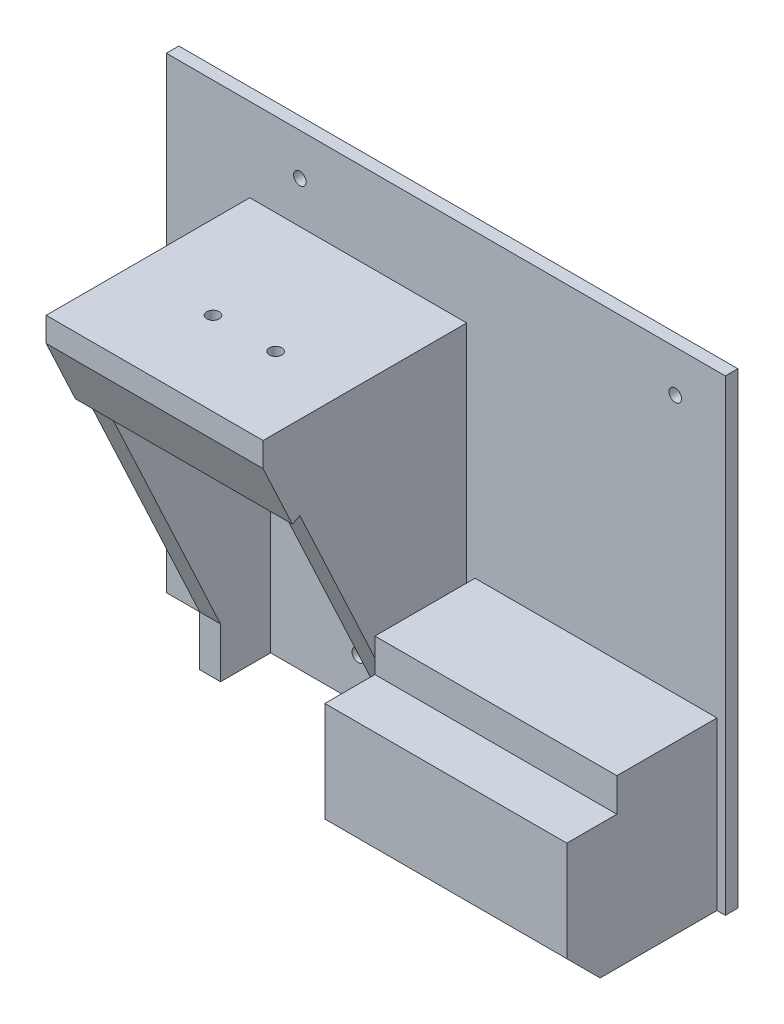
ISO-10303-21;
HEADER;
FILE_DESCRIPTION(('STEP AP214'),'2;1');
FILE_NAME('part.step','',(''),(''),'','','');
FILE_SCHEMA(('AUTOMOTIVE_DESIGN { 1 0 10303 214 1 1 1 1 }'));
ENDSEC;
DATA;
#1=APPLICATION_CONTEXT('core data for automotive mechanical design processes');
#2=APPLICATION_PROTOCOL_DEFINITION('international standard','automotive_design',2000,#1);
#3=PRODUCT_CONTEXT('',#1,'mechanical');
#4=PRODUCT('Part','Part','',(#3));
#5=PRODUCT_RELATED_PRODUCT_CATEGORY('part','',(#4));
#6=PRODUCT_DEFINITION_FORMATION('','',#4);
#7=PRODUCT_DEFINITION_CONTEXT('part definition',#1,'design');
#8=PRODUCT_DEFINITION('design','',#6,#7);
#9=PRODUCT_DEFINITION_SHAPE('','',#8);
#10=(LENGTH_UNIT() NAMED_UNIT(*) SI_UNIT(.MILLI.,.METRE.));
#11=(NAMED_UNIT(*) PLANE_ANGLE_UNIT() SI_UNIT($,.RADIAN.));
#12=(NAMED_UNIT(*) SI_UNIT($,.STERADIAN.) SOLID_ANGLE_UNIT());
#13=UNCERTAINTY_MEASURE_WITH_UNIT(LENGTH_MEASURE(1.E-05),#10,'distance_accuracy_value','');
#14=(GEOMETRIC_REPRESENTATION_CONTEXT(3) GLOBAL_UNCERTAINTY_ASSIGNED_CONTEXT((#13)) GLOBAL_UNIT_ASSIGNED_CONTEXT((#10,
#11,#12)) REPRESENTATION_CONTEXT('',''));
#15=CARTESIAN_POINT('',(0.,0.,0.));
#16=DIRECTION('',(0.,0.,1.));
#17=DIRECTION('',(1.,0.,0.));
#18=AXIS2_PLACEMENT_3D('',#15,#16,#17);
#19=CARTESIAN_POINT('',(96.,-6.,39.));
#20=DIRECTION('',(0.,-1.,0.));
#21=DIRECTION('',(1.,0.,0.));
#22=AXIS2_PLACEMENT_3D('',#19,#20,#21);
#23=PLANE('',#22);
#24=DIRECTION('',(-1.,0.,0.));
#25=VECTOR('',#24,1.);
#26=CARTESIAN_POINT('',(38.,-6.00000000000001,27.));
#27=LINE('',#26,#25);
#28=CARTESIAN_POINT('',(96.,-6.00000000000001,27.));
#29=VERTEX_POINT('',#28);
#30=CARTESIAN_POINT('',(38.,-6.00000000000001,27.));
#31=VERTEX_POINT('',#30);
#32=EDGE_CURVE('E215',#29,#31,#27,.T.);
#33=ORIENTED_EDGE('',*,*,#32,.F.);
#34=DIRECTION('',(0.,0.,-1.));
#35=VECTOR('',#34,1.);
#36=CARTESIAN_POINT('',(96.,-6.,39.));
#37=LINE('',#36,#35);
#38=CARTESIAN_POINT('',(96.,-6.,3.));
#39=VERTEX_POINT('',#38);
#40=EDGE_CURVE('E247',#29,#39,#37,.T.);
#41=ORIENTED_EDGE('',*,*,#40,.T.);
#42=DIRECTION('',(-1.,0.,0.));
#43=VECTOR('',#42,1.);
#44=CARTESIAN_POINT('',(96.,-6.,3.));
#45=LINE('',#44,#43);
#46=CARTESIAN_POINT('',(38.,-6.00000000000001,3.));
#47=VERTEX_POINT('',#46);
#48=EDGE_CURVE('E237',#39,#47,#45,.T.);
#49=ORIENTED_EDGE('',*,*,#48,.T.);
#50=DIRECTION('',(0.,0.,-1.));
#51=VECTOR('',#50,1.);
#52=CARTESIAN_POINT('',(38.,-6.00000000000001,39.));
#53=LINE('',#52,#51);
#54=EDGE_CURVE('E245',#31,#47,#53,.T.);
#55=ORIENTED_EDGE('',*,*,#54,.F.);
#56=EDGE_LOOP('',(#33,#41,#49,#55));
#57=FACE_BOUND('',#56,.T.);
#58=ADVANCED_FACE('F36',(#57),#23,.F.);
#59=CARTESIAN_POINT('',(0.,0.,3.));
#60=DIRECTION('',(0.,0.,-1.));
#61=DIRECTION('',(-1.,0.,0.));
#62=AXIS2_PLACEMENT_3D('',#59,#60,#61);
#63=PLANE('',#62);
#64=CARTESIAN_POINT('',(86.,56.,3.));
#65=DIRECTION('',(0.,0.,1.));
#66=DIRECTION('',(1.,0.,0.));
#67=AXIS2_PLACEMENT_3D('',#64,#65,#66);
#68=CIRCLE('',#67,1.5);
#69=CARTESIAN_POINT('',(87.5,56.,3.));
#70=VERTEX_POINT('',#69);
#71=EDGE_CURVE('E864',#70,#70,#68,.T.);
#72=ORIENTED_EDGE('',*,*,#71,.F.);
#73=EDGE_LOOP('',(#72));
#74=FACE_BOUND('',#73,.T.);
#75=CARTESIAN_POINT('',(-4.,56.,3.));
#76=DIRECTION('',(0.,0.,1.));
#77=DIRECTION('',(1.,0.,0.));
#78=AXIS2_PLACEMENT_3D('',#75,#76,#77);
#79=CIRCLE('',#78,1.5);
#80=CARTESIAN_POINT('',(-2.5,56.,3.));
#81=VERTEX_POINT('',#80);
#82=EDGE_CURVE('E874',#81,#81,#79,.T.);
#83=ORIENTED_EDGE('',*,*,#82,.F.);
#84=EDGE_LOOP('',(#83));
#85=FACE_BOUND('',#84,.T.);
#86=DIRECTION('',(0.,1.,0.));
#87=VECTOR('',#86,1.);
#88=CARTESIAN_POINT('',(96.,-46.,3.));
#89=LINE('',#88,#87);
#90=CARTESIAN_POINT('',(96.,-46.,3.));
#91=VERTEX_POINT('',#90);
#92=EDGE_CURVE('E224',#91,#39,#89,.T.);
#93=ORIENTED_EDGE('',*,*,#92,.F.);
#94=DIRECTION('',(-1.,0.,0.));
#95=VECTOR('',#94,1.);
#96=CARTESIAN_POINT('',(98.,-46.,3.));
#97=LINE('',#96,#95);
#98=CARTESIAN_POINT('',(98.,-46.,3.));
#99=VERTEX_POINT('',#98);
#100=EDGE_CURVE('E266',#99,#91,#97,.T.);
#101=ORIENTED_EDGE('',*,*,#100,.F.);
#102=DIRECTION('',(0.,-1.,0.));
#103=VECTOR('',#102,1.);
#104=CARTESIAN_POINT('',(98.,-46.,3.));
#105=LINE('',#104,#103);
#106=CARTESIAN_POINT('',(98.,66.,3.));
#107=VERTEX_POINT('',#106);
#108=EDGE_CURVE('E255',#107,#99,#105,.T.);
#109=ORIENTED_EDGE('',*,*,#108,.F.);
#110=DIRECTION('',(1.,0.,0.));
#111=VECTOR('',#110,1.);
#112=CARTESIAN_POINT('',(36.,66.,3.));
#113=LINE('',#112,#111);
#114=CARTESIAN_POINT('',(-36.,66.,3.));
#115=VERTEX_POINT('',#114);
#116=EDGE_CURVE('E275',#115,#107,#113,.T.);
#117=ORIENTED_EDGE('',*,*,#116,.F.);
#118=DIRECTION('',(0.,-1.,0.));
#119=VECTOR('',#118,1.);
#120=CARTESIAN_POINT('',(-36.,-46.,3.));
#121=LINE('',#120,#119);
#122=CARTESIAN_POINT('',(-36.,-46.,3.));
#123=VERTEX_POINT('',#122);
#124=EDGE_CURVE('E385',#115,#123,#121,.T.);
#125=ORIENTED_EDGE('',*,*,#124,.T.);
#126=DIRECTION('',(1.,0.,0.));
#127=VECTOR('',#126,1.);
#128=CARTESIAN_POINT('',(-36.,-46.,3.));
#129=LINE('',#128,#127);
#130=CARTESIAN_POINT('',(-16.,-46.,3.));
#131=VERTEX_POINT('',#130);
#132=EDGE_CURVE('E389',#123,#131,#129,.T.);
#133=ORIENTED_EDGE('',*,*,#132,.T.);
#134=DIRECTION('',(0.,-1.,0.));
#135=VECTOR('',#134,1.);
#136=CARTESIAN_POINT('',(-16.,-46.,3.));
#137=LINE('',#136,#135);
#138=CARTESIAN_POINT('',(-16.,46.,3.));
#139=VERTEX_POINT('',#138);
#140=EDGE_CURVE('E369',#139,#131,#137,.T.);
#141=ORIENTED_EDGE('',*,*,#140,.F.);
#142=DIRECTION('',(1.,0.,0.));
#143=VECTOR('',#142,1.);
#144=CARTESIAN_POINT('',(36.,46.,3.));
#145=LINE('',#144,#143);
#146=CARTESIAN_POINT('',(36.,46.,3.));
#147=VERTEX_POINT('',#146);
#148=EDGE_CURVE('E265',#139,#147,#145,.T.);
#149=ORIENTED_EDGE('',*,*,#148,.T.);
#150=DIRECTION('',(0.,-1.,0.));
#151=VECTOR('',#150,1.);
#152=CARTESIAN_POINT('',(36.,-46.,3.));
#153=LINE('',#152,#151);
#154=CARTESIAN_POINT('',(36.,-46.,3.));
#155=VERTEX_POINT('',#154);
#156=EDGE_CURVE('E261',#147,#155,#153,.T.);
#157=ORIENTED_EDGE('',*,*,#156,.T.);
#158=CARTESIAN_POINT('',(38.,-46.,3.));
#159=VERTEX_POINT('',#158);
#160=EDGE_CURVE('E260',#159,#155,#97,.T.);
#161=ORIENTED_EDGE('',*,*,#160,.F.);
#162=DIRECTION('',(0.,-1.,0.));
#163=VECTOR('',#162,1.);
#164=CARTESIAN_POINT('',(38.,-46.,3.));
#165=LINE('',#164,#163);
#166=EDGE_CURVE('E232',#47,#159,#165,.T.);
#167=ORIENTED_EDGE('',*,*,#166,.F.);
#168=ORIENTED_EDGE('',*,*,#48,.F.);
#169=EDGE_LOOP('',(#93,#101,#109,#117,#125,#133,#141,#149,#157,#161,#167,#168));
#170=FACE_BOUND('',#169,.T.);
#171=ADVANCED_FACE('F427',(#74,#85,#170),#63,.F.);
#172=CARTESIAN_POINT('',(36.,-46.,3.));
#173=DIRECTION('',(-1.,0.,0.));
#174=DIRECTION('',(0.,-1.,0.));
#175=AXIS2_PLACEMENT_3D('',#172,#173,#174);
#176=PLANE('',#175);
#177=ORIENTED_EDGE('',*,*,#156,.F.);
#178=DIRECTION('',(0.,0.,-1.));
#179=VECTOR('',#178,1.);
#180=CARTESIAN_POINT('',(36.,46.,3.));
#181=LINE('',#180,#179);
#182=CARTESIAN_POINT('',(36.,46.,51.8123662799905));
#183=VERTEX_POINT('',#182);
#184=EDGE_CURVE('E400',#183,#147,#181,.T.);
#185=ORIENTED_EDGE('',*,*,#184,.F.);
#186=DIRECTION('',(0.,1.,0.));
#187=VECTOR('',#186,1.);
#188=CARTESIAN_POINT('',(36.,0.,51.8123662799905));
#189=LINE('',#188,#187);
#190=CARTESIAN_POINT('',(36.,40.1542290693378,51.8123662799905));
#191=VERTEX_POINT('',#190);
#192=EDGE_CURVE('E310',#191,#183,#189,.T.);
#193=ORIENTED_EDGE('',*,*,#192,.F.);
#194=DIRECTION('',(0.,0.906183139995265,0.422885465331124));
#195=VECTOR('',#194,1.);
#196=CARTESIAN_POINT('',(36.,40.1542290693378,51.8123662799905));
#197=LINE('',#196,#195);
#198=CARTESIAN_POINT('',(36.,25.1542290693377,44.8123662799905));
#199=VERTEX_POINT('',#198);
#200=EDGE_CURVE('E322',#199,#191,#197,.T.);
#201=ORIENTED_EDGE('',*,*,#200,.F.);
#202=DIRECTION('',(0.,0.422885465331124,-0.906183139995265));
#203=VECTOR('',#202,1.);
#204=CARTESIAN_POINT('',(36.,25.1542290693377,44.8123662799905));
#205=LINE('',#204,#203);
#206=CARTESIAN_POINT('',(36.,26.,43.));
#207=VERTEX_POINT('',#206);
#208=EDGE_CURVE('E328',#199,#207,#205,.T.);
#209=ORIENTED_EDGE('',*,*,#208,.T.);
#210=DIRECTION('',(0.,0.906183139995265,0.422885465331124));
#211=VECTOR('',#210,1.);
#212=CARTESIAN_POINT('',(36.,-11.8284671532847,25.3467153284672));
#213=LINE('',#212,#211);
#214=CARTESIAN_POINT('',(36.,-34.,15.));
#215=VERTEX_POINT('',#214);
#216=EDGE_CURVE('E342',#215,#207,#213,.T.);
#217=ORIENTED_EDGE('',*,*,#216,.F.);
#218=DIRECTION('',(0.,1.,0.));
#219=VECTOR('',#218,1.);
#220=CARTESIAN_POINT('',(36.,0.,15.));
#221=LINE('',#220,#219);
#222=CARTESIAN_POINT('',(36.,-46.,15.));
#223=VERTEX_POINT('',#222);
#224=EDGE_CURVE('E364',#223,#215,#221,.T.);
#225=ORIENTED_EDGE('',*,*,#224,.F.);
#226=DIRECTION('',(0.,0.,-1.));
#227=VECTOR('',#226,1.);
#228=CARTESIAN_POINT('',(36.,-46.,3.));
#229=LINE('',#228,#227);
#230=EDGE_CURVE('E392',#223,#155,#229,.T.);
#231=ORIENTED_EDGE('',*,*,#230,.T.);
#232=EDGE_LOOP('',(#177,#185,#193,#201,#209,#217,#225,#231));
#233=FACE_BOUND('',#232,.T.);
#234=ADVANCED_FACE('F425',(#233),#176,.F.);
#235=CARTESIAN_POINT('',(-36.,46.,3.));
#236=DIRECTION('',(0.,-1.,0.));
#237=DIRECTION('',(0.,0.,-1.));
#238=AXIS2_PLACEMENT_3D('',#235,#236,#237);
#239=PLANE('',#238);
#240=CARTESIAN_POINT('',(19.,46.,31.8123662799905));
#241=DIRECTION('',(0.,1.,0.));
#242=DIRECTION('',(0.,0.,1.));
#243=AXIS2_PLACEMENT_3D('',#240,#241,#242);
#244=CIRCLE('',#243,1.5);
#245=CARTESIAN_POINT('',(19.,46.,33.3123662799905));
#246=VERTEX_POINT('',#245);
#247=EDGE_CURVE('E288',#246,#246,#244,.T.);
#248=ORIENTED_EDGE('',*,*,#247,.F.);
#249=EDGE_LOOP('',(#248));
#250=FACE_BOUND('',#249,.T.);
#251=CARTESIAN_POINT('',(3.99999999999998,46.,31.8123662799905));
#252=DIRECTION('',(0.,1.,0.));
#253=DIRECTION('',(0.,0.,1.));
#254=AXIS2_PLACEMENT_3D('',#251,#252,#253);
#255=CIRCLE('',#254,1.5);
#256=CARTESIAN_POINT('',(3.99999999999998,46.,33.3123662799905));
#257=VERTEX_POINT('',#256);
#258=EDGE_CURVE('E281',#257,#257,#255,.T.);
#259=ORIENTED_EDGE('',*,*,#258,.F.);
#260=EDGE_LOOP('',(#259));
#261=FACE_BOUND('',#260,.T.);
#262=ORIENTED_EDGE('',*,*,#148,.F.);
#263=DIRECTION('',(0.,0.,-1.));
#264=VECTOR('',#263,1.);
#265=CARTESIAN_POINT('',(-16.,46.,50.));
#266=LINE('',#265,#264);
#267=CARTESIAN_POINT('',(-16.,46.,51.8123662799905));
#268=VERTEX_POINT('',#267);
#269=EDGE_CURVE('E376',#268,#139,#266,.T.);
#270=ORIENTED_EDGE('',*,*,#269,.F.);
#271=DIRECTION('',(-1.,0.,0.));
#272=VECTOR('',#271,1.);
#273=CARTESIAN_POINT('',(0.,46.,51.8123662799905));
#274=LINE('',#273,#272);
#275=EDGE_CURVE('E313',#183,#268,#274,.T.);
#276=ORIENTED_EDGE('',*,*,#275,.F.);
#277=ORIENTED_EDGE('',*,*,#184,.T.);
#278=EDGE_LOOP('',(#262,#270,#276,#277));
#279=FACE_BOUND('',#278,.T.);
#280=ADVANCED_FACE('F430',(#250,#261,#279),#239,.F.);
#281=CARTESIAN_POINT('',(36.001,-11.8284671532847,25.3467153284672));
#282=DIRECTION('',(0.,0.422885465331124,-0.906183139995265));
#283=DIRECTION('',(0.,0.906183139995265,0.422885465331124));
#284=AXIS2_PLACEMENT_3D('',#281,#282,#283);
#285=PLANE('',#284);
#286=DIRECTION('',(1.,0.,0.));
#287=VECTOR('',#286,1.);
#288=CARTESIAN_POINT('',(-16.,26.,43.));
#289=LINE('',#288,#287);
#290=CARTESIAN_POINT('',(-16.,26.,43.));
#291=VERTEX_POINT('',#290);
#292=CARTESIAN_POINT('',(-11.,26.,43.));
#293=VERTEX_POINT('',#292);
#294=EDGE_CURVE('E316',#291,#293,#289,.T.);
#295=ORIENTED_EDGE('',*,*,#294,.F.);
#296=DIRECTION('',(0.,-0.906183139995265,-0.422885465331124));
#297=VECTOR('',#296,1.);
#298=CARTESIAN_POINT('',(-16.,-11.8284671532847,25.3467153284672));
#299=LINE('',#298,#297);
#300=CARTESIAN_POINT('',(-16.,-34.,15.));
#301=VERTEX_POINT('',#300);
#302=EDGE_CURVE('E347',#291,#301,#299,.T.);
#303=ORIENTED_EDGE('',*,*,#302,.T.);
#304=DIRECTION('',(-1.,0.,0.));
#305=VECTOR('',#304,1.);
#306=CARTESIAN_POINT('',(36.001,-34.,15.));
#307=LINE('',#306,#305);
#308=CARTESIAN_POINT('',(-11.,-34.,15.));
#309=VERTEX_POINT('',#308);
#310=EDGE_CURVE('E351',#309,#301,#307,.T.);
#311=ORIENTED_EDGE('',*,*,#310,.F.);
#312=DIRECTION('',(0.,0.906183139995265,0.422885465331124));
#313=VECTOR('',#312,1.);
#314=CARTESIAN_POINT('',(-11.,-11.8284671532847,25.3467153284672));
#315=LINE('',#314,#313);
#316=EDGE_CURVE('E336',#309,#293,#315,.T.);
#317=ORIENTED_EDGE('',*,*,#316,.T.);
#318=EDGE_LOOP('',(#295,#303,#311,#317));
#319=FACE_BOUND('',#318,.T.);
#320=ADVANCED_FACE('F473',(#319),#285,.F.);
#321=DIRECTION('',(1.,0.,0.));
#322=VECTOR('',#321,1.);
#323=CARTESIAN_POINT('',(36.001,26.,43.));
#324=LINE('',#323,#322);
#325=CARTESIAN_POINT('',(31.,26.,43.));
#326=VERTEX_POINT('',#325);
#327=EDGE_CURVE('E280',#326,#207,#324,.T.);
#328=ORIENTED_EDGE('',*,*,#327,.F.);
#329=DIRECTION('',(0.,-0.906183139995265,-0.422885465331124));
#330=VECTOR('',#329,1.);
#331=CARTESIAN_POINT('',(31.,-11.8284671532847,25.3467153284672));
#332=LINE('',#331,#330);
#333=CARTESIAN_POINT('',(31.,-34.,15.));
#334=VERTEX_POINT('',#333);
#335=EDGE_CURVE('E339',#326,#334,#332,.T.);
#336=ORIENTED_EDGE('',*,*,#335,.T.);
#337=EDGE_CURVE('E356',#215,#334,#307,.T.);
#338=ORIENTED_EDGE('',*,*,#337,.F.);
#339=ORIENTED_EDGE('',*,*,#216,.T.);
#340=EDGE_LOOP('',(#328,#336,#338,#339));
#341=FACE_BOUND('',#340,.T.);
#342=ADVANCED_FACE('F447',(#341),#285,.F.);
#343=CARTESIAN_POINT('',(9.99999999999998,-36.,3.));
#344=DIRECTION('',(0.,0.,1.));
#345=DIRECTION('',(1.,0.,0.));
#346=AXIS2_PLACEMENT_3D('',#343,#344,#345);
#347=CIRCLE('',#346,1.5);
#348=CARTESIAN_POINT('',(11.5,-36.,3.));
#349=VERTEX_POINT('',#348);
#350=EDGE_CURVE('E866',#349,#349,#347,.T.);
#351=ORIENTED_EDGE('',*,*,#350,.F.);
#352=EDGE_LOOP('',(#351));
#353=FACE_BOUND('',#352,.T.);
#354=DIRECTION('',(0.,-1.,0.));
#355=VECTOR('',#354,1.);
#356=CARTESIAN_POINT('',(31.,-46.,3.));
#357=LINE('',#356,#355);
#358=CARTESIAN_POINT('',(31.,43.,3.));
#359=VERTEX_POINT('',#358);
#360=CARTESIAN_POINT('',(31.,-46.,3.));
#361=VERTEX_POINT('',#360);
#362=EDGE_CURVE('E379',#359,#361,#357,.T.);
#363=ORIENTED_EDGE('',*,*,#362,.F.);
#364=DIRECTION('',(1.,0.,0.));
#365=VECTOR('',#364,1.);
#366=CARTESIAN_POINT('',(-11.,43.,3.));
#367=LINE('',#366,#365);
#368=CARTESIAN_POINT('',(-11.,43.,3.));
#369=VERTEX_POINT('',#368);
#370=EDGE_CURVE('E301',#369,#359,#367,.T.);
#371=ORIENTED_EDGE('',*,*,#370,.F.);
#372=DIRECTION('',(0.,1.,0.));
#373=VECTOR('',#372,1.);
#374=CARTESIAN_POINT('',(-11.,-46.,3.));
#375=LINE('',#374,#373);
#376=CARTESIAN_POINT('',(-11.,-46.,3.));
#377=VERTEX_POINT('',#376);
#378=EDGE_CURVE('E367',#377,#369,#375,.T.);
#379=ORIENTED_EDGE('',*,*,#378,.F.);
#380=EDGE_CURVE('E387',#377,#361,#129,.T.);
#381=ORIENTED_EDGE('',*,*,#380,.T.);
#382=EDGE_LOOP('',(#363,#371,#379,#381));
#383=FACE_BOUND('',#382,.T.);
#384=ADVANCED_FACE('F462',(#353,#383),#63,.F.);
#385=CARTESIAN_POINT('',(-36.,-46.,3.));
#386=DIRECTION('',(1.,0.,0.));
#387=DIRECTION('',(0.,1.,0.));
#388=AXIS2_PLACEMENT_3D('',#385,#386,#387);
#389=PLANE('',#388);
#390=DIRECTION('',(0.,-1.,0.));
#391=VECTOR('',#390,1.);
#392=CARTESIAN_POINT('',(-36.,-46.,0.));
#393=LINE('',#392,#391);
#394=CARTESIAN_POINT('',(-36.,66.,0.));
#395=VERTEX_POINT('',#394);
#396=CARTESIAN_POINT('',(-36.,-46.,0.));
#397=VERTEX_POINT('',#396);
#398=EDGE_CURVE('E384',#395,#397,#393,.T.);
#399=ORIENTED_EDGE('',*,*,#398,.T.);
#400=DIRECTION('',(0.,0.,-1.));
#401=VECTOR('',#400,1.);
#402=CARTESIAN_POINT('',(-36.,-46.,3.));
#403=LINE('',#402,#401);
#404=EDGE_CURVE('E397',#123,#397,#403,.T.);
#405=ORIENTED_EDGE('',*,*,#404,.F.);
#406=ORIENTED_EDGE('',*,*,#124,.F.);
#407=DIRECTION('',(0.,0.,1.));
#408=VECTOR('',#407,1.);
#409=CARTESIAN_POINT('',(-36.,66.,0.));
#410=LINE('',#409,#408);
#411=EDGE_CURVE('E272',#395,#115,#410,.T.);
#412=ORIENTED_EDGE('',*,*,#411,.F.);
#413=EDGE_LOOP('',(#399,#405,#406,#412));
#414=FACE_BOUND('',#413,.T.);
#415=ADVANCED_FACE('F488',(#414),#389,.F.);
#416=CARTESIAN_POINT('',(-36.,-46.,3.));
#417=DIRECTION('',(0.,1.,0.));
#418=DIRECTION('',(0.,0.,1.));
#419=AXIS2_PLACEMENT_3D('',#416,#417,#418);
#420=PLANE('',#419);
#421=DIRECTION('',(0.,0.,-1.));
#422=VECTOR('',#421,1.);
#423=CARTESIAN_POINT('',(96.,-46.,39.));
#424=LINE('',#423,#422);
#425=CARTESIAN_POINT('',(96.,-46.,31.));
#426=VERTEX_POINT('',#425);
#427=EDGE_CURVE('E234',#426,#91,#424,.T.);
#428=ORIENTED_EDGE('',*,*,#427,.F.);
#429=DIRECTION('',(-1.,0.,0.));
#430=VECTOR('',#429,1.);
#431=CARTESIAN_POINT('',(38.,-46.,31.));
#432=LINE('',#431,#430);
#433=CARTESIAN_POINT('',(38.,-46.,31.));
#434=VERTEX_POINT('',#433);
#435=EDGE_CURVE('E45',#426,#434,#432,.T.);
#436=ORIENTED_EDGE('',*,*,#435,.T.);
#437=DIRECTION('',(0.,0.,-1.));
#438=VECTOR('',#437,1.);
#439=CARTESIAN_POINT('',(38.,-46.,39.));
#440=LINE('',#439,#438);
#441=EDGE_CURVE('E243',#434,#159,#440,.T.);
#442=ORIENTED_EDGE('',*,*,#441,.T.);
#443=ORIENTED_EDGE('',*,*,#160,.T.);
#444=ORIENTED_EDGE('',*,*,#230,.F.);
#445=DIRECTION('',(-1.,0.,0.));
#446=VECTOR('',#445,1.);
#447=CARTESIAN_POINT('',(36.001,-46.,15.));
#448=LINE('',#447,#446);
#449=CARTESIAN_POINT('',(31.,-46.,15.));
#450=VERTEX_POINT('',#449);
#451=EDGE_CURVE('E355',#223,#450,#448,.T.);
#452=ORIENTED_EDGE('',*,*,#451,.T.);
#453=DIRECTION('',(0.,0.,-1.));
#454=VECTOR('',#453,1.);
#455=CARTESIAN_POINT('',(31.,-46.,50.));
#456=LINE('',#455,#454);
#457=EDGE_CURVE('E382',#450,#361,#456,.T.);
#458=ORIENTED_EDGE('',*,*,#457,.T.);
#459=ORIENTED_EDGE('',*,*,#380,.F.);
#460=DIRECTION('',(0.,0.,-1.));
#461=VECTOR('',#460,1.);
#462=CARTESIAN_POINT('',(-11.,-46.,50.));
#463=LINE('',#462,#461);
#464=CARTESIAN_POINT('',(-11.,-46.,15.));
#465=VERTEX_POINT('',#464);
#466=EDGE_CURVE('E372',#465,#377,#463,.T.);
#467=ORIENTED_EDGE('',*,*,#466,.F.);
#468=CARTESIAN_POINT('',(-16.,-46.,15.));
#469=VERTEX_POINT('',#468);
#470=EDGE_CURVE('E352',#465,#469,#448,.T.);
#471=ORIENTED_EDGE('',*,*,#470,.T.);
#472=DIRECTION('',(0.,0.,-1.));
#473=VECTOR('',#472,1.);
#474=CARTESIAN_POINT('',(-16.,-46.,50.));
#475=LINE('',#474,#473);
#476=EDGE_CURVE('E374',#469,#131,#475,.T.);
#477=ORIENTED_EDGE('',*,*,#476,.T.);
#478=ORIENTED_EDGE('',*,*,#132,.F.);
#479=ORIENTED_EDGE('',*,*,#404,.T.);
#480=DIRECTION('',(1.,0.,0.));
#481=VECTOR('',#480,1.);
#482=CARTESIAN_POINT('',(-36.,-46.,0.));
#483=LINE('',#482,#481);
#484=CARTESIAN_POINT('',(98.,-46.,0.));
#485=VERTEX_POINT('',#484);
#486=EDGE_CURVE('E388',#397,#485,#483,.T.);
#487=ORIENTED_EDGE('',*,*,#486,.T.);
#488=DIRECTION('',(0.,0.,-1.));
#489=VECTOR('',#488,1.);
#490=CARTESIAN_POINT('',(98.,-46.,0.));
#491=LINE('',#490,#489);
#492=EDGE_CURVE('E257',#99,#485,#491,.T.);
#493=ORIENTED_EDGE('',*,*,#492,.F.);
#494=ORIENTED_EDGE('',*,*,#100,.T.);
#495=EDGE_LOOP('',(#428,#436,#442,#443,#444,#452,#458,#459,#467,#471,#477,#478,#479,#487,#493,#494));
#496=FACE_BOUND('',#495,.T.);
#497=ADVANCED_FACE('F414',(#496),#420,.F.);
#498=CARTESIAN_POINT('',(0.,0.,0.));
#499=DIRECTION('',(0.,0.,-1.));
#500=DIRECTION('',(-1.,0.,0.));
#501=AXIS2_PLACEMENT_3D('',#498,#499,#500);
#502=PLANE('',#501);
#503=CARTESIAN_POINT('',(86.,56.,0.));
#504=DIRECTION('',(0.,0.,-1.));
#505=DIRECTION('',(-1.,0.,0.));
#506=AXIS2_PLACEMENT_3D('',#503,#504,#505);
#507=CIRCLE('',#506,1.5);
#508=CARTESIAN_POINT('',(84.5,56.,0.));
#509=VERTEX_POINT('',#508);
#510=EDGE_CURVE('E861',#509,#509,#507,.F.);
#511=ORIENTED_EDGE('',*,*,#510,.T.);
#512=EDGE_LOOP('',(#511));
#513=FACE_BOUND('',#512,.T.);
#514=CARTESIAN_POINT('',(9.99999999999998,-36.,0.));
#515=DIRECTION('',(0.,0.,-1.));
#516=DIRECTION('',(-1.,0.,0.));
#517=AXIS2_PLACEMENT_3D('',#514,#515,#516);
#518=CIRCLE('',#517,1.5);
#519=CARTESIAN_POINT('',(8.49999999999998,-36.,0.));
#520=VERTEX_POINT('',#519);
#521=EDGE_CURVE('E871',#520,#520,#518,.F.);
#522=ORIENTED_EDGE('',*,*,#521,.T.);
#523=EDGE_LOOP('',(#522));
#524=FACE_BOUND('',#523,.T.);
#525=CARTESIAN_POINT('',(-4.,56.,0.));
#526=DIRECTION('',(0.,0.,-1.));
#527=DIRECTION('',(-1.,0.,0.));
#528=AXIS2_PLACEMENT_3D('',#525,#526,#527);
#529=CIRCLE('',#528,1.5);
#530=CARTESIAN_POINT('',(-5.50000000000001,56.,0.));
#531=VERTEX_POINT('',#530);
#532=EDGE_CURVE('E877',#531,#531,#529,.F.);
#533=ORIENTED_EDGE('',*,*,#532,.T.);
#534=EDGE_LOOP('',(#533));
#535=FACE_BOUND('',#534,.T.);
#536=DIRECTION('',(-1.,0.,0.));
#537=VECTOR('',#536,1.);
#538=CARTESIAN_POINT('',(36.,66.,0.));
#539=LINE('',#538,#537);
#540=CARTESIAN_POINT('',(98.,66.,0.));
#541=VERTEX_POINT('',#540);
#542=EDGE_CURVE('E269',#541,#395,#539,.T.);
#543=ORIENTED_EDGE('',*,*,#542,.F.);
#544=DIRECTION('',(0.,1.,0.));
#545=VECTOR('',#544,1.);
#546=CARTESIAN_POINT('',(98.,-46.,0.));
#547=LINE('',#546,#545);
#548=EDGE_CURVE('E249',#485,#541,#547,.T.);
#549=ORIENTED_EDGE('',*,*,#548,.F.);
#550=ORIENTED_EDGE('',*,*,#486,.F.);
#551=ORIENTED_EDGE('',*,*,#398,.F.);
#552=EDGE_LOOP('',(#543,#549,#550,#551));
#553=FACE_BOUND('',#552,.T.);
#554=ADVANCED_FACE('F492',(#513,#524,#535,#553),#502,.T.);
#555=CARTESIAN_POINT('',(31.,-46.,50.));
#556=DIRECTION('',(1.,0.,0.));
#557=DIRECTION('',(0.,0.,-1.));
#558=AXIS2_PLACEMENT_3D('',#555,#556,#557);
#559=PLANE('',#558);
#560=DIRECTION('',(0.,-1.,0.));
#561=VECTOR('',#560,1.);
#562=CARTESIAN_POINT('',(31.,0.,15.));
#563=LINE('',#562,#561);
#564=EDGE_CURVE('E362',#334,#450,#563,.T.);
#565=ORIENTED_EDGE('',*,*,#564,.F.);
#566=ORIENTED_EDGE('',*,*,#335,.F.);
#567=DIRECTION('',(0.,-1.,0.));
#568=VECTOR('',#567,1.);
#569=CARTESIAN_POINT('',(31.,43.,43.));
#570=LINE('',#569,#568);
#571=CARTESIAN_POINT('',(31.,43.,43.));
#572=VERTEX_POINT('',#571);
#573=EDGE_CURVE('E304',#572,#326,#570,.T.);
#574=ORIENTED_EDGE('',*,*,#573,.F.);
#575=DIRECTION('',(0.,0.,1.));
#576=VECTOR('',#575,1.);
#577=CARTESIAN_POINT('',(31.,43.,3.));
#578=LINE('',#577,#576);
#579=EDGE_CURVE('E284',#359,#572,#578,.T.);
#580=ORIENTED_EDGE('',*,*,#579,.F.);
#581=ORIENTED_EDGE('',*,*,#362,.T.);
#582=ORIENTED_EDGE('',*,*,#457,.F.);
#583=EDGE_LOOP('',(#565,#566,#574,#580,#581,#582));
#584=FACE_BOUND('',#583,.T.);
#585=ADVANCED_FACE('F450',(#584),#559,.F.);
#586=CARTESIAN_POINT('',(-11.,-46.,50.));
#587=DIRECTION('',(-1.,0.,0.));
#588=DIRECTION('',(0.,0.,1.));
#589=AXIS2_PLACEMENT_3D('',#586,#587,#588);
#590=PLANE('',#589);
#591=ORIENTED_EDGE('',*,*,#378,.T.);
#592=DIRECTION('',(0.,0.,-1.));
#593=VECTOR('',#592,1.);
#594=CARTESIAN_POINT('',(-11.,43.,43.));
#595=LINE('',#594,#593);
#596=CARTESIAN_POINT('',(-11.,43.,43.));
#597=VERTEX_POINT('',#596);
#598=EDGE_CURVE('E298',#597,#369,#595,.T.);
#599=ORIENTED_EDGE('',*,*,#598,.F.);
#600=DIRECTION('',(0.,-1.,0.));
#601=VECTOR('',#600,1.);
#602=CARTESIAN_POINT('',(-11.,43.,43.));
#603=LINE('',#602,#601);
#604=EDGE_CURVE('E305',#597,#293,#603,.T.);
#605=ORIENTED_EDGE('',*,*,#604,.T.);
#606=ORIENTED_EDGE('',*,*,#316,.F.);
#607=DIRECTION('',(0.,1.,0.));
#608=VECTOR('',#607,1.);
#609=CARTESIAN_POINT('',(-11.,0.,15.));
#610=LINE('',#609,#608);
#611=EDGE_CURVE('E359',#465,#309,#610,.T.);
#612=ORIENTED_EDGE('',*,*,#611,.F.);
#613=ORIENTED_EDGE('',*,*,#466,.T.);
#614=EDGE_LOOP('',(#591,#599,#605,#606,#612,#613));
#615=FACE_BOUND('',#614,.T.);
#616=ADVANCED_FACE('F465',(#615),#590,.F.);
#617=CARTESIAN_POINT('',(-16.,-46.,50.));
#618=DIRECTION('',(1.,0.,0.));
#619=DIRECTION('',(0.,1.,0.));
#620=AXIS2_PLACEMENT_3D('',#617,#618,#619);
#621=PLANE('',#620);
#622=DIRECTION('',(0.,-0.906183139995265,-0.422885465331124));
#623=VECTOR('',#622,1.);
#624=CARTESIAN_POINT('',(-16.,40.1542290693378,51.8123662799905));
#625=LINE('',#624,#623);
#626=CARTESIAN_POINT('',(-16.,40.1542290693378,51.8123662799905));
#627=VERTEX_POINT('',#626);
#628=CARTESIAN_POINT('',(-16.,25.1542290693377,44.8123662799905));
#629=VERTEX_POINT('',#628);
#630=EDGE_CURVE('E317',#627,#629,#625,.T.);
#631=ORIENTED_EDGE('',*,*,#630,.F.);
#632=DIRECTION('',(0.,-1.,0.));
#633=VECTOR('',#632,1.);
#634=CARTESIAN_POINT('',(-16.,0.,51.8123662799905));
#635=LINE('',#634,#633);
#636=EDGE_CURVE('E307',#268,#627,#635,.T.);
#637=ORIENTED_EDGE('',*,*,#636,.F.);
#638=ORIENTED_EDGE('',*,*,#269,.T.);
#639=ORIENTED_EDGE('',*,*,#140,.T.);
#640=ORIENTED_EDGE('',*,*,#476,.F.);
#641=DIRECTION('',(0.,-1.,0.));
#642=VECTOR('',#641,1.);
#643=CARTESIAN_POINT('',(-16.,0.,15.));
#644=LINE('',#643,#642);
#645=EDGE_CURVE('E349',#301,#469,#644,.T.);
#646=ORIENTED_EDGE('',*,*,#645,.F.);
#647=ORIENTED_EDGE('',*,*,#302,.F.);
#648=DIRECTION('',(0.,0.422885465331124,-0.906183139995265));
#649=VECTOR('',#648,1.);
#650=CARTESIAN_POINT('',(-16.,25.1542290693377,44.8123662799905));
#651=LINE('',#650,#649);
#652=EDGE_CURVE('E333',#629,#291,#651,.T.);
#653=ORIENTED_EDGE('',*,*,#652,.F.);
#654=EDGE_LOOP('',(#631,#637,#638,#639,#640,#646,#647,#653));
#655=FACE_BOUND('',#654,.T.);
#656=ADVANCED_FACE('F477',(#655),#621,.F.);
#657=CARTESIAN_POINT('',(36.001,0.,15.));
#658=DIRECTION('',(0.,0.,-1.));
#659=DIRECTION('',(-1.,0.,0.));
#660=AXIS2_PLACEMENT_3D('',#657,#658,#659);
#661=PLANE('',#660);
#662=ORIENTED_EDGE('',*,*,#224,.T.);
#663=ORIENTED_EDGE('',*,*,#337,.T.);
#664=ORIENTED_EDGE('',*,*,#564,.T.);
#665=ORIENTED_EDGE('',*,*,#451,.F.);
#666=EDGE_LOOP('',(#662,#663,#664,#665));
#667=FACE_BOUND('',#666,.T.);
#668=ADVANCED_FACE('F455',(#667),#661,.F.);
#669=ORIENTED_EDGE('',*,*,#611,.T.);
#670=ORIENTED_EDGE('',*,*,#310,.T.);
#671=ORIENTED_EDGE('',*,*,#645,.T.);
#672=ORIENTED_EDGE('',*,*,#470,.F.);
#673=EDGE_LOOP('',(#669,#670,#671,#672));
#674=FACE_BOUND('',#673,.T.);
#675=ADVANCED_FACE('F481',(#674),#661,.F.);
#676=CARTESIAN_POINT('',(-16.,25.1542290693377,44.8123662799905));
#677=DIRECTION('',(0.,0.906183139995265,0.422885465331124));
#678=DIRECTION('',(0.,-0.422885465331124,0.906183139995265));
#679=AXIS2_PLACEMENT_3D('',#676,#677,#678);
#680=PLANE('',#679);
#681=ORIENTED_EDGE('',*,*,#294,.T.);
#682=DIRECTION('',(-1.,0.,0.));
#683=VECTOR('',#682,1.);
#684=CARTESIAN_POINT('',(36.001,26.,43.));
#685=LINE('',#684,#683);
#686=EDGE_CURVE('E344',#326,#293,#685,.T.);
#687=ORIENTED_EDGE('',*,*,#686,.F.);
#688=ORIENTED_EDGE('',*,*,#327,.T.);
#689=ORIENTED_EDGE('',*,*,#208,.F.);
#690=DIRECTION('',(1.,0.,0.));
#691=VECTOR('',#690,1.);
#692=CARTESIAN_POINT('',(-16.,25.1542290693377,44.8123662799905));
#693=LINE('',#692,#691);
#694=EDGE_CURVE('E320',#629,#199,#693,.T.);
#695=ORIENTED_EDGE('',*,*,#694,.F.);
#696=ORIENTED_EDGE('',*,*,#652,.T.);
#697=EDGE_LOOP('',(#681,#687,#688,#689,#695,#696));
#698=FACE_BOUND('',#697,.T.);
#699=ADVANCED_FACE('F442',(#698),#680,.F.);
#700=CARTESIAN_POINT('',(0.,-12.6742380839469,27.1590816084577));
#701=DIRECTION('',(0.,-0.422885465331124,0.906183139995265));
#702=DIRECTION('',(0.,-0.906183139995265,-0.422885465331124));
#703=AXIS2_PLACEMENT_3D('',#700,#701,#702);
#704=PLANE('',#703);
#705=ORIENTED_EDGE('',*,*,#630,.T.);
#706=ORIENTED_EDGE('',*,*,#694,.T.);
#707=ORIENTED_EDGE('',*,*,#200,.T.);
#708=DIRECTION('',(-1.,0.,0.));
#709=VECTOR('',#708,1.);
#710=CARTESIAN_POINT('',(-16.,40.1542290693378,51.8123662799905));
#711=LINE('',#710,#709);
#712=EDGE_CURVE('E325',#191,#627,#711,.T.);
#713=ORIENTED_EDGE('',*,*,#712,.T.);
#714=EDGE_LOOP('',(#705,#706,#707,#713));
#715=FACE_BOUND('',#714,.T.);
#716=ADVANCED_FACE('F439',(#715),#704,.T.);
#717=CARTESIAN_POINT('',(0.,0.,51.8123662799905));
#718=DIRECTION('',(0.,0.,1.));
#719=DIRECTION('',(1.,0.,0.));
#720=AXIS2_PLACEMENT_3D('',#717,#718,#719);
#721=PLANE('',#720);
#722=ORIENTED_EDGE('',*,*,#636,.T.);
#723=ORIENTED_EDGE('',*,*,#712,.F.);
#724=ORIENTED_EDGE('',*,*,#192,.T.);
#725=ORIENTED_EDGE('',*,*,#275,.T.);
#726=EDGE_LOOP('',(#722,#723,#724,#725));
#727=FACE_BOUND('',#726,.T.);
#728=ADVANCED_FACE('F435',(#727),#721,.T.);
#729=CARTESIAN_POINT('',(31.,43.,43.));
#730=DIRECTION('',(0.,0.,1.));
#731=DIRECTION('',(1.,0.,0.));
#732=AXIS2_PLACEMENT_3D('',#729,#730,#731);
#733=PLANE('',#732);
#734=ORIENTED_EDGE('',*,*,#686,.T.);
#735=ORIENTED_EDGE('',*,*,#604,.F.);
#736=DIRECTION('',(-1.,0.,0.));
#737=VECTOR('',#736,1.);
#738=CARTESIAN_POINT('',(31.,43.,43.));
#739=LINE('',#738,#737);
#740=EDGE_CURVE('E295',#572,#597,#739,.T.);
#741=ORIENTED_EDGE('',*,*,#740,.F.);
#742=ORIENTED_EDGE('',*,*,#573,.T.);
#743=EDGE_LOOP('',(#734,#735,#741,#742));
#744=FACE_BOUND('',#743,.T.);
#745=ADVANCED_FACE('F470',(#744),#733,.F.);
#746=CARTESIAN_POINT('',(0.,43.,0.));
#747=DIRECTION('',(0.,-1.,0.));
#748=DIRECTION('',(1.,0.,0.));
#749=AXIS2_PLACEMENT_3D('',#746,#747,#748);
#750=PLANE('',#749);
#751=CARTESIAN_POINT('',(3.99999999999998,43.,31.8123662799905));
#752=DIRECTION('',(0.,-1.,0.));
#753=DIRECTION('',(1.,0.,0.));
#754=AXIS2_PLACEMENT_3D('',#751,#752,#753);
#755=CIRCLE('',#754,1.5);
#756=CARTESIAN_POINT('',(5.49999999999998,43.,31.8123662799905));
#757=VERTEX_POINT('',#756);
#758=EDGE_CURVE('E285',#757,#757,#755,.F.);
#759=ORIENTED_EDGE('',*,*,#758,.T.);
#760=EDGE_LOOP('',(#759));
#761=FACE_BOUND('',#760,.T.);
#762=CARTESIAN_POINT('',(19.,43.,31.8123662799905));
#763=DIRECTION('',(0.,-1.,0.));
#764=DIRECTION('',(1.,0.,0.));
#765=AXIS2_PLACEMENT_3D('',#762,#763,#764);
#766=CIRCLE('',#765,1.5);
#767=CARTESIAN_POINT('',(20.5,43.,31.8123662799905));
#768=VERTEX_POINT('',#767);
#769=EDGE_CURVE('E277',#768,#768,#766,.F.);
#770=ORIENTED_EDGE('',*,*,#769,.T.);
#771=EDGE_LOOP('',(#770));
#772=FACE_BOUND('',#771,.T.);
#773=ORIENTED_EDGE('',*,*,#579,.T.);
#774=ORIENTED_EDGE('',*,*,#740,.T.);
#775=ORIENTED_EDGE('',*,*,#598,.T.);
#776=ORIENTED_EDGE('',*,*,#370,.T.);
#777=EDGE_LOOP('',(#773,#774,#775,#776));
#778=FACE_BOUND('',#777,.T.);
#779=ADVANCED_FACE('F468',(#761,#772,#778),#750,.T.);
#780=CARTESIAN_POINT('',(19.,-46.001,31.8123662799905));
#781=DIRECTION('',(0.,1.,0.));
#782=DIRECTION('',(0.,0.,1.));
#783=AXIS2_PLACEMENT_3D('',#780,#781,#782);
#784=CYLINDRICAL_SURFACE('',#783,1.5);
#785=ORIENTED_EDGE('',*,*,#769,.F.);
#786=EDGE_LOOP('',(#785));
#787=FACE_BOUND('',#786,.T.);
#788=ORIENTED_EDGE('',*,*,#247,.T.);
#789=EDGE_LOOP('',(#788));
#790=FACE_BOUND('',#789,.T.);
#791=ADVANCED_FACE('F520',(#787,#790),#784,.F.);
#792=CARTESIAN_POINT('',(3.99999999999998,-46.001,31.8123662799905));
#793=DIRECTION('',(0.,1.,0.));
#794=DIRECTION('',(0.,0.,1.));
#795=AXIS2_PLACEMENT_3D('',#792,#793,#794);
#796=CYLINDRICAL_SURFACE('',#795,1.5);
#797=ORIENTED_EDGE('',*,*,#758,.F.);
#798=EDGE_LOOP('',(#797));
#799=FACE_BOUND('',#798,.T.);
#800=ORIENTED_EDGE('',*,*,#258,.T.);
#801=EDGE_LOOP('',(#800));
#802=FACE_BOUND('',#801,.T.);
#803=ADVANCED_FACE('F516',(#799,#802),#796,.F.);
#804=CARTESIAN_POINT('',(0.,66.,0.));
#805=DIRECTION('',(0.,-1.,0.));
#806=DIRECTION('',(0.,0.,-1.));
#807=AXIS2_PLACEMENT_3D('',#804,#805,#806);
#808=PLANE('',#807);
#809=ORIENTED_EDGE('',*,*,#116,.T.);
#810=DIRECTION('',(0.,0.,1.));
#811=VECTOR('',#810,1.);
#812=CARTESIAN_POINT('',(98.,66.,0.));
#813=LINE('',#812,#811);
#814=EDGE_CURVE('E252',#541,#107,#813,.T.);
#815=ORIENTED_EDGE('',*,*,#814,.F.);
#816=ORIENTED_EDGE('',*,*,#542,.T.);
#817=ORIENTED_EDGE('',*,*,#411,.T.);
#818=EDGE_LOOP('',(#809,#815,#816,#817));
#819=FACE_BOUND('',#818,.T.);
#820=ADVANCED_FACE('F513',(#819),#808,.F.);
#821=CARTESIAN_POINT('',(98.,0.,0.));
#822=DIRECTION('',(1.,0.,0.));
#823=DIRECTION('',(0.,1.,0.));
#824=AXIS2_PLACEMENT_3D('',#821,#822,#823);
#825=PLANE('',#824);
#826=ORIENTED_EDGE('',*,*,#548,.T.);
#827=ORIENTED_EDGE('',*,*,#814,.T.);
#828=ORIENTED_EDGE('',*,*,#108,.T.);
#829=ORIENTED_EDGE('',*,*,#492,.T.);
#830=EDGE_LOOP('',(#826,#827,#828,#829));
#831=FACE_BOUND('',#830,.T.);
#832=ADVANCED_FACE('F495',(#831),#825,.T.);
#833=CARTESIAN_POINT('',(96.,-46.,39.));
#834=DIRECTION('',(-1.,0.,0.));
#835=DIRECTION('',(0.,0.,1.));
#836=AXIS2_PLACEMENT_3D('',#833,#834,#835);
#837=PLANE('',#836);
#838=DIRECTION('',(0.,1.,0.));
#839=VECTOR('',#838,1.);
#840=CARTESIAN_POINT('',(96.,-6.00000000000001,27.));
#841=LINE('',#840,#839);
#842=CARTESIAN_POINT('',(96.,-14.,27.));
#843=VERTEX_POINT('',#842);
#844=EDGE_CURVE('E209',#843,#29,#841,.T.);
#845=ORIENTED_EDGE('',*,*,#844,.F.);
#846=DIRECTION('',(0.,0.,1.));
#847=VECTOR('',#846,1.);
#848=CARTESIAN_POINT('',(96.,-14.,27.));
#849=LINE('',#848,#847);
#850=CARTESIAN_POINT('',(96.,-14.,39.));
#851=VERTEX_POINT('',#850);
#852=EDGE_CURVE('E206',#843,#851,#849,.T.);
#853=ORIENTED_EDGE('',*,*,#852,.T.);
#854=DIRECTION('',(0.,1.,0.));
#855=VECTOR('',#854,1.);
#856=CARTESIAN_POINT('',(96.,-46.,39.));
#857=LINE('',#856,#855);
#858=CARTESIAN_POINT('',(96.,-38.,39.));
#859=VERTEX_POINT('',#858);
#860=EDGE_CURVE('E229',#859,#851,#857,.T.);
#861=ORIENTED_EDGE('',*,*,#860,.F.);
#862=DIRECTION('',(0.,-0.707106781186546,-0.707106781186549));
#863=VECTOR('',#862,1.);
#864=CARTESIAN_POINT('',(96.,-38.,39.));
#865=LINE('',#864,#863);
#866=EDGE_CURVE('E407',#859,#426,#865,.T.);
#867=ORIENTED_EDGE('',*,*,#866,.T.);
#868=ORIENTED_EDGE('',*,*,#427,.T.);
#869=ORIENTED_EDGE('',*,*,#92,.T.);
#870=ORIENTED_EDGE('',*,*,#40,.F.);
#871=EDGE_LOOP('',(#845,#853,#861,#867,#868,#869,#870));
#872=FACE_BOUND('',#871,.T.);
#873=ADVANCED_FACE('F410',(#872),#837,.F.);
#874=CARTESIAN_POINT('',(38.,-46.,39.));
#875=DIRECTION('',(1.,0.,0.));
#876=DIRECTION('',(0.,0.,-1.));
#877=AXIS2_PLACEMENT_3D('',#874,#875,#876);
#878=PLANE('',#877);
#879=DIRECTION('',(0.,-1.,0.));
#880=VECTOR('',#879,1.);
#881=CARTESIAN_POINT('',(38.,-46.,39.));
#882=LINE('',#881,#880);
#883=CARTESIAN_POINT('',(38.,-14.,39.));
#884=VERTEX_POINT('',#883);
#885=CARTESIAN_POINT('',(38.,-38.,39.));
#886=VERTEX_POINT('',#885);
#887=EDGE_CURVE('E222',#884,#886,#882,.T.);
#888=ORIENTED_EDGE('',*,*,#887,.F.);
#889=DIRECTION('',(0.,0.,1.));
#890=VECTOR('',#889,1.);
#891=CARTESIAN_POINT('',(38.,-14.,27.));
#892=LINE('',#891,#890);
#893=CARTESIAN_POINT('',(38.,-14.,27.));
#894=VERTEX_POINT('',#893);
#895=EDGE_CURVE('E52',#894,#884,#892,.T.);
#896=ORIENTED_EDGE('',*,*,#895,.F.);
#897=DIRECTION('',(0.,-1.,0.));
#898=VECTOR('',#897,1.);
#899=CARTESIAN_POINT('',(38.,-6.00000000000001,27.));
#900=LINE('',#899,#898);
#901=EDGE_CURVE('E210',#31,#894,#900,.T.);
#902=ORIENTED_EDGE('',*,*,#901,.F.);
#903=ORIENTED_EDGE('',*,*,#54,.T.);
#904=ORIENTED_EDGE('',*,*,#166,.T.);
#905=ORIENTED_EDGE('',*,*,#441,.F.);
#906=DIRECTION('',(0.,0.707106781186546,0.707106781186549));
#907=VECTOR('',#906,1.);
#908=CARTESIAN_POINT('',(38.,-38.,39.));
#909=LINE('',#908,#907);
#910=EDGE_CURVE('E11',#434,#886,#909,.T.);
#911=ORIENTED_EDGE('',*,*,#910,.T.);
#912=EDGE_LOOP('',(#888,#896,#902,#903,#904,#905,#911));
#913=FACE_BOUND('',#912,.T.);
#914=ADVANCED_FACE('F221',(#913),#878,.F.);
#915=CARTESIAN_POINT('',(0.,0.,39.));
#916=DIRECTION('',(0.,0.,1.));
#917=DIRECTION('',(1.,0.,0.));
#918=AXIS2_PLACEMENT_3D('',#915,#916,#917);
#919=PLANE('',#918);
#920=DIRECTION('',(1.,0.,0.));
#921=VECTOR('',#920,1.);
#922=CARTESIAN_POINT('',(38.,-14.,39.));
#923=LINE('',#922,#921);
#924=EDGE_CURVE('E218',#884,#851,#923,.T.);
#925=ORIENTED_EDGE('',*,*,#924,.F.);
#926=ORIENTED_EDGE('',*,*,#887,.T.);
#927=DIRECTION('',(1.,0.,0.));
#928=VECTOR('',#927,1.);
#929=CARTESIAN_POINT('',(96.,-38.,39.));
#930=LINE('',#929,#928);
#931=EDGE_CURVE('E264',#886,#859,#930,.T.);
#932=ORIENTED_EDGE('',*,*,#931,.T.);
#933=ORIENTED_EDGE('',*,*,#860,.T.);
#934=EDGE_LOOP('',(#925,#926,#932,#933));
#935=FACE_BOUND('',#934,.T.);
#936=ADVANCED_FACE('F660',(#935),#919,.T.);
#937=CARTESIAN_POINT('',(0.,-38.,39.));
#938=DIRECTION('',(0.,-0.707106781186549,0.707106781186546));
#939=DIRECTION('',(-1.,0.,0.));
#940=AXIS2_PLACEMENT_3D('',#937,#938,#939);
#941=PLANE('',#940);
#942=ORIENTED_EDGE('',*,*,#910,.F.);
#943=ORIENTED_EDGE('',*,*,#435,.F.);
#944=ORIENTED_EDGE('',*,*,#866,.F.);
#945=ORIENTED_EDGE('',*,*,#931,.F.);
#946=EDGE_LOOP('',(#942,#943,#944,#945));
#947=FACE_BOUND('',#946,.T.);
#948=ADVANCED_FACE('F39',(#947),#941,.T.);
#949=CARTESIAN_POINT('',(38.,-14.,27.));
#950=DIRECTION('',(0.,-1.,0.));
#951=DIRECTION('',(0.,0.,-1.));
#952=AXIS2_PLACEMENT_3D('',#949,#950,#951);
#953=PLANE('',#952);
#954=ORIENTED_EDGE('',*,*,#924,.T.);
#955=ORIENTED_EDGE('',*,*,#852,.F.);
#956=DIRECTION('',(1.,0.,0.));
#957=VECTOR('',#956,1.);
#958=CARTESIAN_POINT('',(38.,-14.,27.));
#959=LINE('',#958,#957);
#960=EDGE_CURVE('E202',#894,#843,#959,.T.);
#961=ORIENTED_EDGE('',*,*,#960,.F.);
#962=ORIENTED_EDGE('',*,*,#895,.T.);
#963=EDGE_LOOP('',(#954,#955,#961,#962));
#964=FACE_BOUND('',#963,.T.);
#965=ADVANCED_FACE('F204',(#964),#953,.F.);
#966=CARTESIAN_POINT('',(0.,0.,27.));
#967=DIRECTION('',(0.,0.,1.));
#968=DIRECTION('',(1.,0.,0.));
#969=AXIS2_PLACEMENT_3D('',#966,#967,#968);
#970=PLANE('',#969);
#971=ORIENTED_EDGE('',*,*,#901,.T.);
#972=ORIENTED_EDGE('',*,*,#960,.T.);
#973=ORIENTED_EDGE('',*,*,#844,.T.);
#974=ORIENTED_EDGE('',*,*,#32,.T.);
#975=EDGE_LOOP('',(#971,#972,#973,#974));
#976=FACE_BOUND('',#975,.T.);
#977=ADVANCED_FACE('F213',(#976),#970,.T.);
#978=CARTESIAN_POINT('',(-4.,56.,-0.00100000000000013));
#979=DIRECTION('',(0.,0.,1.));
#980=DIRECTION('',(1.,0.,0.));
#981=AXIS2_PLACEMENT_3D('',#978,#979,#980);
#982=CYLINDRICAL_SURFACE('',#981,1.5);
#983=ORIENTED_EDGE('',*,*,#532,.F.);
#984=EDGE_LOOP('',(#983));
#985=FACE_BOUND('',#984,.T.);
#986=ORIENTED_EDGE('',*,*,#82,.T.);
#987=EDGE_LOOP('',(#986));
#988=FACE_BOUND('',#987,.T.);
#989=ADVANCED_FACE('F682',(#985,#988),#982,.F.);
#990=CARTESIAN_POINT('',(9.99999999999998,-36.,-0.00100000000000013));
#991=DIRECTION('',(0.,0.,1.));
#992=DIRECTION('',(1.,0.,0.));
#993=AXIS2_PLACEMENT_3D('',#990,#991,#992);
#994=CYLINDRICAL_SURFACE('',#993,1.5);
#995=ORIENTED_EDGE('',*,*,#521,.F.);
#996=EDGE_LOOP('',(#995));
#997=FACE_BOUND('',#996,.T.);
#998=ORIENTED_EDGE('',*,*,#350,.T.);
#999=EDGE_LOOP('',(#998));
#1000=FACE_BOUND('',#999,.T.);
#1001=ADVANCED_FACE('F688',(#997,#1000),#994,.F.);
#1002=CARTESIAN_POINT('',(86.,56.,-0.00100000000000013));
#1003=DIRECTION('',(0.,0.,1.));
#1004=DIRECTION('',(1.,0.,0.));
#1005=AXIS2_PLACEMENT_3D('',#1002,#1003,#1004);
#1006=CYLINDRICAL_SURFACE('',#1005,1.5);
#1007=ORIENTED_EDGE('',*,*,#510,.F.);
#1008=EDGE_LOOP('',(#1007));
#1009=FACE_BOUND('',#1008,.T.);
#1010=ORIENTED_EDGE('',*,*,#71,.T.);
#1011=EDGE_LOOP('',(#1010));
#1012=FACE_BOUND('',#1011,.T.);
#1013=ADVANCED_FACE('F696',(#1009,#1012),#1006,.F.);
#1014=CLOSED_SHELL('',(#58,#171,#234,#280,#320,#342,#384,#415,#497,#554,#585,#616,#656,#668,
#675,#699,#716,#728,#745,#779,#791,#803,#820,#832,#873,#914,#936,#948,#965,#977,#989,#1001,#1013));
#1015=MANIFOLD_SOLID_BREP('B2',#1014);
#1016=ADVANCED_BREP_SHAPE_REPRESENTATION('',(#18,#1015),#14);
#1017=SHAPE_DEFINITION_REPRESENTATION(#9,#1016);
ENDSEC;
END-ISO-10303-21;
